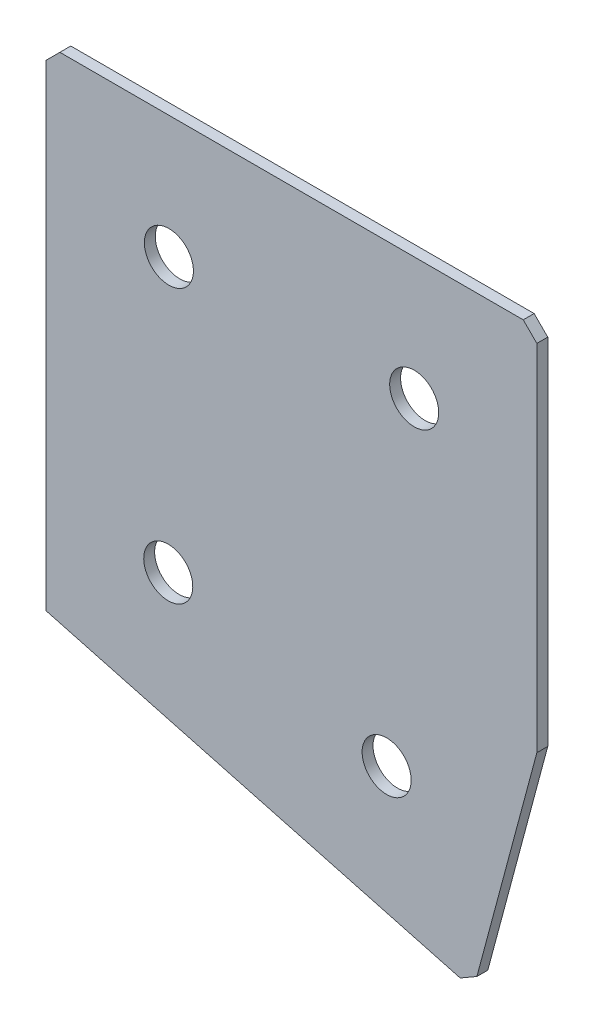
ISO-10303-21;
HEADER;
FILE_DESCRIPTION(('STEP AP214'),'2;1');
FILE_NAME('part.step','',(''),(''),'','','');
FILE_SCHEMA(('AUTOMOTIVE_DESIGN { 1 0 10303 214 1 1 1 1 }'));
ENDSEC;
DATA;
#1=APPLICATION_CONTEXT('core data for automotive mechanical design processes');
#2=APPLICATION_PROTOCOL_DEFINITION('international standard','automotive_design',2000,#1);
#3=PRODUCT_CONTEXT('',#1,'mechanical');
#4=PRODUCT('Part','Part','',(#3));
#5=PRODUCT_RELATED_PRODUCT_CATEGORY('part','',(#4));
#6=PRODUCT_DEFINITION_FORMATION('','',#4);
#7=PRODUCT_DEFINITION_CONTEXT('part definition',#1,'design');
#8=PRODUCT_DEFINITION('design','',#6,#7);
#9=PRODUCT_DEFINITION_SHAPE('','',#8);
#10=(LENGTH_UNIT() NAMED_UNIT(*) SI_UNIT(.MILLI.,.METRE.));
#11=(NAMED_UNIT(*) PLANE_ANGLE_UNIT() SI_UNIT($,.RADIAN.));
#12=(NAMED_UNIT(*) SI_UNIT($,.STERADIAN.) SOLID_ANGLE_UNIT());
#13=UNCERTAINTY_MEASURE_WITH_UNIT(LENGTH_MEASURE(1.E-05),#10,'distance_accuracy_value','');
#14=(GEOMETRIC_REPRESENTATION_CONTEXT(3) GLOBAL_UNCERTAINTY_ASSIGNED_CONTEXT((#13)) GLOBAL_UNIT_ASSIGNED_CONTEXT((#10,
#11,#12)) REPRESENTATION_CONTEXT('',''));
#15=CARTESIAN_POINT('',(0.,0.,0.));
#16=DIRECTION('',(0.,0.,1.));
#17=DIRECTION('',(1.,0.,0.));
#18=AXIS2_PLACEMENT_3D('',#15,#16,#17);
#19=CARTESIAN_POINT('',(0.,0.,-2.));
#20=DIRECTION('',(1.,0.,0.));
#21=DIRECTION('',(0.,0.,-1.));
#22=AXIS2_PLACEMENT_3D('',#19,#20,#21);
#23=PLANE('',#22);
#24=DIRECTION('',(0.,1.,0.));
#25=VECTOR('',#24,1.);
#26=CARTESIAN_POINT('',(0.,0.,0.));
#27=LINE('',#26,#25);
#28=CARTESIAN_POINT('',(0.,-90.,0.));
#29=VERTEX_POINT('',#28);
#30=CARTESIAN_POINT('',(0.,-2.5,0.));
#31=VERTEX_POINT('',#30);
#32=EDGE_CURVE('E137',#29,#31,#27,.T.);
#33=ORIENTED_EDGE('',*,*,#32,.T.);
#34=DIRECTION('',(0.,0.,-1.));
#35=VECTOR('',#34,1.);
#36=CARTESIAN_POINT('',(0.,-2.5,-2.));
#37=LINE('',#36,#35);
#38=CARTESIAN_POINT('',(0.,-2.5,-2.));
#39=VERTEX_POINT('',#38);
#40=EDGE_CURVE('E11',#31,#39,#37,.T.);
#41=ORIENTED_EDGE('',*,*,#40,.T.);
#42=DIRECTION('',(0.,1.,0.));
#43=VECTOR('',#42,1.);
#44=CARTESIAN_POINT('',(0.,0.,-2.));
#45=LINE('',#44,#43);
#46=CARTESIAN_POINT('',(0.,-90.,-2.));
#47=VERTEX_POINT('',#46);
#48=EDGE_CURVE('E153',#47,#39,#45,.T.);
#49=ORIENTED_EDGE('',*,*,#48,.F.);
#50=DIRECTION('',(0.,0.,1.));
#51=VECTOR('',#50,1.);
#52=CARTESIAN_POINT('',(0.,-90.,-2.));
#53=LINE('',#52,#51);
#54=EDGE_CURVE('E125',#47,#29,#53,.T.);
#55=ORIENTED_EDGE('',*,*,#54,.T.);
#56=EDGE_LOOP('',(#33,#41,#49,#55));
#57=FACE_BOUND('',#56,.T.);
#58=ADVANCED_FACE('F39',(#57),#23,.F.);
#59=CARTESIAN_POINT('',(0.,0.,-2.));
#60=DIRECTION('',(0.,-1.,0.));
#61=DIRECTION('',(0.,0.,-1.));
#62=AXIS2_PLACEMENT_3D('',#59,#60,#61);
#63=PLANE('',#62);
#64=DIRECTION('',(1.,0.,0.));
#65=VECTOR('',#64,1.);
#66=CARTESIAN_POINT('',(0.,0.,0.));
#67=LINE('',#66,#65);
#68=CARTESIAN_POINT('',(2.5,0.,0.));
#69=VERTEX_POINT('',#68);
#70=CARTESIAN_POINT('',(87.4999999999999,0.,0.));
#71=VERTEX_POINT('',#70);
#72=EDGE_CURVE('E141',#69,#71,#67,.T.);
#73=ORIENTED_EDGE('',*,*,#72,.T.);
#74=DIRECTION('',(0.,0.,-1.));
#75=VECTOR('',#74,1.);
#76=CARTESIAN_POINT('',(87.5,0.,-2.));
#77=LINE('',#76,#75);
#78=CARTESIAN_POINT('',(87.4999999999999,0.,-2.));
#79=VERTEX_POINT('',#78);
#80=EDGE_CURVE('E48',#71,#79,#77,.T.);
#81=ORIENTED_EDGE('',*,*,#80,.T.);
#82=DIRECTION('',(1.,0.,0.));
#83=VECTOR('',#82,1.);
#84=CARTESIAN_POINT('',(0.,0.,-2.));
#85=LINE('',#84,#83);
#86=CARTESIAN_POINT('',(2.5,0.,-2.));
#87=VERTEX_POINT('',#86);
#88=EDGE_CURVE('E113',#87,#79,#85,.T.);
#89=ORIENTED_EDGE('',*,*,#88,.F.);
#90=DIRECTION('',(0.,0.,1.));
#91=VECTOR('',#90,1.);
#92=CARTESIAN_POINT('',(2.5,0.,-2.));
#93=LINE('',#92,#91);
#94=EDGE_CURVE('E182',#87,#69,#93,.T.);
#95=ORIENTED_EDGE('',*,*,#94,.T.);
#96=EDGE_LOOP('',(#73,#81,#89,#95));
#97=FACE_BOUND('',#96,.T.);
#98=ADVANCED_FACE('F188',(#97),#63,.F.);
#99=CARTESIAN_POINT('',(90.,0.,-2.));
#100=DIRECTION('',(-1.,0.,0.));
#101=DIRECTION('',(0.,0.,1.));
#102=AXIS2_PLACEMENT_3D('',#99,#100,#101);
#103=PLANE('',#102);
#104=DIRECTION('',(0.,-1.,0.));
#105=VECTOR('',#104,1.);
#106=CARTESIAN_POINT('',(90.,0.,-2.));
#107=LINE('',#106,#105);
#108=CARTESIAN_POINT('',(90.,-2.50000000000003,-2.));
#109=VERTEX_POINT('',#108);
#110=CARTESIAN_POINT('',(90.,-67.5279992003474,-2.));
#111=VERTEX_POINT('',#110);
#112=EDGE_CURVE('E103',#109,#111,#107,.T.);
#113=ORIENTED_EDGE('',*,*,#112,.F.);
#114=DIRECTION('',(0.,0.,1.));
#115=VECTOR('',#114,1.);
#116=CARTESIAN_POINT('',(90.,-2.50000000000003,-2.));
#117=LINE('',#116,#115);
#118=CARTESIAN_POINT('',(90.,-2.50000000000003,0.));
#119=VERTEX_POINT('',#118);
#120=EDGE_CURVE('E179',#109,#119,#117,.T.);
#121=ORIENTED_EDGE('',*,*,#120,.T.);
#122=DIRECTION('',(0.,-1.,0.));
#123=VECTOR('',#122,1.);
#124=CARTESIAN_POINT('',(90.,0.,0.));
#125=LINE('',#124,#123);
#126=CARTESIAN_POINT('',(90.,-67.5279992003474,0.));
#127=VERTEX_POINT('',#126);
#128=EDGE_CURVE('E119',#119,#127,#125,.T.);
#129=ORIENTED_EDGE('',*,*,#128,.T.);
#130=DIRECTION('',(0.,0.,1.));
#131=VECTOR('',#130,1.);
#132=CARTESIAN_POINT('',(90.,-67.5279992003474,-2.));
#133=LINE('',#132,#131);
#134=EDGE_CURVE('E116',#111,#127,#133,.T.);
#135=ORIENTED_EDGE('',*,*,#134,.F.);
#136=EDGE_LOOP('',(#113,#121,#129,#135));
#137=FACE_BOUND('',#136,.T.);
#138=ADVANCED_FACE('F117',(#137),#103,.F.);
#139=CARTESIAN_POINT('',(78.3531429703865,-110.994661383355,-2.));
#140=DIRECTION('',(-0.965925826289068,0.258819045102521,0.));
#141=DIRECTION('',(-0.258819045102521,-0.965925826289068,0.));
#142=AXIS2_PLACEMENT_3D('',#139,#140,#141);
#143=PLANE('',#142);
#144=DIRECTION('',(-0.258819045102521,-0.965925826289068,0.));
#145=VECTOR('',#144,1.);
#146=CARTESIAN_POINT('',(78.3531429703865,-110.994661383355,0.));
#147=LINE('',#146,#145);
#148=CARTESIAN_POINT('',(79.0001905831429,-108.579846817633,0.));
#149=VERTEX_POINT('',#148);
#150=EDGE_CURVE('E147',#127,#149,#147,.T.);
#151=ORIENTED_EDGE('',*,*,#150,.T.);
#152=DIRECTION('',(0.,0.,-1.));
#153=VECTOR('',#152,1.);
#154=CARTESIAN_POINT('',(79.0001905831429,-108.579846817633,-2.));
#155=LINE('',#154,#153);
#156=CARTESIAN_POINT('',(79.0001905831429,-108.579846817633,-2.));
#157=VERTEX_POINT('',#156);
#158=EDGE_CURVE('E129',#149,#157,#155,.T.);
#159=ORIENTED_EDGE('',*,*,#158,.T.);
#160=DIRECTION('',(-0.258819045102521,-0.965925826289068,0.));
#161=VECTOR('',#160,1.);
#162=CARTESIAN_POINT('',(78.3531429703865,-110.994661383355,-2.));
#163=LINE('',#162,#161);
#164=EDGE_CURVE('E107',#111,#157,#163,.T.);
#165=ORIENTED_EDGE('',*,*,#164,.F.);
#166=ORIENTED_EDGE('',*,*,#134,.T.);
#167=EDGE_LOOP('',(#151,#159,#165,#166));
#168=FACE_BOUND('',#167,.T.);
#169=ADVANCED_FACE('F127',(#168),#143,.F.);
#170=CARTESIAN_POINT('',(0.,-90.,-2.));
#171=DIRECTION('',(0.258819045102522,0.965925826289068,0.));
#172=DIRECTION('',(-0.965925826289068,0.258819045102522,0.));
#173=AXIS2_PLACEMENT_3D('',#170,#171,#172);
#174=PLANE('',#173);
#175=DIRECTION('',(-0.965925826289068,0.258819045102522,0.));
#176=VECTOR('',#175,1.);
#177=CARTESIAN_POINT('',(0.,-90.,-2.));
#178=LINE('',#177,#176);
#179=CARTESIAN_POINT('',(75.9383284046638,-110.347613770599,-2.));
#180=VERTEX_POINT('',#179);
#181=EDGE_CURVE('E131',#180,#47,#178,.T.);
#182=ORIENTED_EDGE('',*,*,#181,.F.);
#183=DIRECTION('',(0.,0.,1.));
#184=VECTOR('',#183,1.);
#185=CARTESIAN_POINT('',(75.9383284046638,-110.347613770599,-2.));
#186=LINE('',#185,#184);
#187=CARTESIAN_POINT('',(75.9383284046638,-110.347613770599,0.));
#188=VERTEX_POINT('',#187);
#189=EDGE_CURVE('E124',#180,#188,#186,.T.);
#190=ORIENTED_EDGE('',*,*,#189,.T.);
#191=DIRECTION('',(-0.965925826289068,0.258819045102522,0.));
#192=VECTOR('',#191,1.);
#193=CARTESIAN_POINT('',(0.,-90.,0.));
#194=LINE('',#193,#192);
#195=EDGE_CURVE('E150',#188,#29,#194,.T.);
#196=ORIENTED_EDGE('',*,*,#195,.T.);
#197=ORIENTED_EDGE('',*,*,#54,.F.);
#198=EDGE_LOOP('',(#182,#190,#196,#197));
#199=FACE_BOUND('',#198,.T.);
#200=ADVANCED_FACE('F218',(#199),#174,.F.);
#201=CARTESIAN_POINT('',(0.,0.,-2.));
#202=DIRECTION('',(0.,0.,1.));
#203=DIRECTION('',(1.,0.,0.));
#204=AXIS2_PLACEMENT_3D('',#201,#202,#203);
#205=PLANE('',#204);
#206=CARTESIAN_POINT('',(22.3803787042603,-72.7030903408824,-2.));
#207=DIRECTION('',(0.,0.,-1.));
#208=DIRECTION('',(0.,1.,0.));
#209=AXIS2_PLACEMENT_3D('',#206,#207,#208);
#210=CIRCLE('',#209,4.5);
#211=CARTESIAN_POINT('',(22.3803787042603,-68.2030903408824,-2.));
#212=VERTEX_POINT('',#211);
#213=EDGE_CURVE('E250',#212,#212,#210,.T.);
#214=ORIENTED_EDGE('',*,*,#213,.F.);
#215=EDGE_LOOP('',(#214));
#216=FACE_BOUND('',#215,.T.);
#217=CARTESIAN_POINT('',(62.4432403936892,-83.4379017770447,-2.00000000000001));
#218=DIRECTION('',(0.,0.,-1.));
#219=DIRECTION('',(0.,1.,0.));
#220=AXIS2_PLACEMENT_3D('',#217,#218,#219);
#221=CIRCLE('',#220,4.5);
#222=CARTESIAN_POINT('',(62.4432403936892,-78.9379017770447,-2.));
#223=VERTEX_POINT('',#222);
#224=EDGE_CURVE('E254',#223,#223,#221,.T.);
#225=ORIENTED_EDGE('',*,*,#224,.F.);
#226=EDGE_LOOP('',(#225));
#227=FACE_BOUND('',#226,.T.);
#228=CARTESIAN_POINT('',(22.5,-22.5,-2.));
#229=DIRECTION('',(0.,0.,-1.));
#230=DIRECTION('',(0.,1.,0.));
#231=AXIS2_PLACEMENT_3D('',#228,#229,#230);
#232=CIRCLE('',#231,4.5);
#233=CARTESIAN_POINT('',(22.5,-18.,-2.));
#234=VERTEX_POINT('',#233);
#235=EDGE_CURVE('E264',#234,#234,#232,.T.);
#236=ORIENTED_EDGE('',*,*,#235,.F.);
#237=EDGE_LOOP('',(#236));
#238=FACE_BOUND('',#237,.T.);
#239=CARTESIAN_POINT('',(67.5,-22.5,-2.));
#240=DIRECTION('',(0.,0.,-1.));
#241=DIRECTION('',(0.,1.,0.));
#242=AXIS2_PLACEMENT_3D('',#239,#240,#241);
#243=CIRCLE('',#242,4.5);
#244=CARTESIAN_POINT('',(67.5,-18.,-2.));
#245=VERTEX_POINT('',#244);
#246=EDGE_CURVE('E272',#245,#245,#243,.T.);
#247=ORIENTED_EDGE('',*,*,#246,.F.);
#248=EDGE_LOOP('',(#247));
#249=FACE_BOUND('',#248,.T.);
#250=ORIENTED_EDGE('',*,*,#164,.T.);
#251=DIRECTION('',(0.866025403784437,0.500000000000003,0.));
#252=VECTOR('',#251,1.);
#253=CARTESIAN_POINT('',(75.9383284046639,-110.347613770599,-2.));
#254=LINE('',#253,#252);
#255=EDGE_CURVE('E176',#157,#180,#254,.F.);
#256=ORIENTED_EDGE('',*,*,#255,.T.);
#257=ORIENTED_EDGE('',*,*,#181,.T.);
#258=ORIENTED_EDGE('',*,*,#48,.T.);
#259=DIRECTION('',(-0.707106781186548,-0.707106781186548,0.));
#260=VECTOR('',#259,1.);
#261=CARTESIAN_POINT('',(2.5,0.,-2.));
#262=LINE('',#261,#260);
#263=EDGE_CURVE('E171',#39,#87,#262,.F.);
#264=ORIENTED_EDGE('',*,*,#263,.T.);
#265=ORIENTED_EDGE('',*,*,#88,.T.);
#266=DIRECTION('',(-0.707106781186548,0.707106781186548,0.));
#267=VECTOR('',#266,1.);
#268=CARTESIAN_POINT('',(90.,-2.50000000000003,-2.));
#269=LINE('',#268,#267);
#270=EDGE_CURVE('E55',#79,#109,#269,.F.);
#271=ORIENTED_EDGE('',*,*,#270,.T.);
#272=ORIENTED_EDGE('',*,*,#112,.T.);
#273=EDGE_LOOP('',(#250,#256,#257,#258,#264,#265,#271,#272));
#274=FACE_BOUND('',#273,.T.);
#275=ADVANCED_FACE('F105',(#216,#227,#238,#249,#274),#205,.F.);
#276=CARTESIAN_POINT('',(0.,0.,0.));
#277=DIRECTION('',(0.,0.,1.));
#278=DIRECTION('',(1.,0.,0.));
#279=AXIS2_PLACEMENT_3D('',#276,#277,#278);
#280=PLANE('',#279);
#281=CARTESIAN_POINT('',(22.3803787042603,-72.7030903408824,0.));
#282=DIRECTION('',(0.,0.,-1.));
#283=DIRECTION('',(0.,1.,0.));
#284=AXIS2_PLACEMENT_3D('',#281,#282,#283);
#285=CIRCLE('',#284,4.5);
#286=CARTESIAN_POINT('',(22.3803787042603,-68.2030903408824,0.));
#287=VERTEX_POINT('',#286);
#288=EDGE_CURVE('E247',#287,#287,#285,.T.);
#289=ORIENTED_EDGE('',*,*,#288,.T.);
#290=EDGE_LOOP('',(#289));
#291=FACE_BOUND('',#290,.T.);
#292=CARTESIAN_POINT('',(62.4432403936892,-83.4379017770447,0.));
#293=DIRECTION('',(0.,0.,-1.));
#294=DIRECTION('',(0.,1.,0.));
#295=AXIS2_PLACEMENT_3D('',#292,#293,#294);
#296=CIRCLE('',#295,4.5);
#297=CARTESIAN_POINT('',(62.4432403936892,-78.9379017770447,0.));
#298=VERTEX_POINT('',#297);
#299=EDGE_CURVE('E260',#298,#298,#296,.T.);
#300=ORIENTED_EDGE('',*,*,#299,.T.);
#301=EDGE_LOOP('',(#300));
#302=FACE_BOUND('',#301,.T.);
#303=CARTESIAN_POINT('',(22.5,-22.5,0.));
#304=DIRECTION('',(0.,0.,-1.));
#305=DIRECTION('',(0.,1.,0.));
#306=AXIS2_PLACEMENT_3D('',#303,#304,#305);
#307=CIRCLE('',#306,4.5);
#308=CARTESIAN_POINT('',(22.5,-18.,0.));
#309=VERTEX_POINT('',#308);
#310=EDGE_CURVE('E268',#309,#309,#307,.T.);
#311=ORIENTED_EDGE('',*,*,#310,.T.);
#312=EDGE_LOOP('',(#311));
#313=FACE_BOUND('',#312,.T.);
#314=CARTESIAN_POINT('',(67.5,-22.5,0.));
#315=DIRECTION('',(0.,0.,-1.));
#316=DIRECTION('',(0.,1.,0.));
#317=AXIS2_PLACEMENT_3D('',#314,#315,#316);
#318=CIRCLE('',#317,4.5);
#319=CARTESIAN_POINT('',(67.5,-18.,0.));
#320=VERTEX_POINT('',#319);
#321=EDGE_CURVE('E142',#320,#320,#318,.T.);
#322=ORIENTED_EDGE('',*,*,#321,.T.);
#323=EDGE_LOOP('',(#322));
#324=FACE_BOUND('',#323,.T.);
#325=ORIENTED_EDGE('',*,*,#195,.F.);
#326=DIRECTION('',(-0.866025403784437,-0.500000000000003,0.));
#327=VECTOR('',#326,1.);
#328=CARTESIAN_POINT('',(66.7665004873326,-115.642971087631,0.));
#329=LINE('',#328,#327);
#330=EDGE_CURVE('E166',#188,#149,#329,.F.);
#331=ORIENTED_EDGE('',*,*,#330,.T.);
#332=ORIENTED_EDGE('',*,*,#150,.F.);
#333=ORIENTED_EDGE('',*,*,#128,.F.);
#334=DIRECTION('',(0.707106781186548,-0.707106781186548,0.));
#335=VECTOR('',#334,1.);
#336=CARTESIAN_POINT('',(43.75,43.75,0.));
#337=LINE('',#336,#335);
#338=EDGE_CURVE('E163',#119,#71,#337,.F.);
#339=ORIENTED_EDGE('',*,*,#338,.T.);
#340=ORIENTED_EDGE('',*,*,#72,.F.);
#341=DIRECTION('',(0.707106781186548,0.707106781186548,0.));
#342=VECTOR('',#341,1.);
#343=CARTESIAN_POINT('',(1.25,-1.25,0.));
#344=LINE('',#343,#342);
#345=EDGE_CURVE('E160',#69,#31,#344,.F.);
#346=ORIENTED_EDGE('',*,*,#345,.T.);
#347=ORIENTED_EDGE('',*,*,#32,.F.);
#348=EDGE_LOOP('',(#325,#331,#332,#333,#339,#340,#346,#347));
#349=FACE_BOUND('',#348,.T.);
#350=ADVANCED_FACE('F193',(#291,#302,#313,#324,#349),#280,.T.);
#351=CARTESIAN_POINT('',(67.5,-22.5,-2.));
#352=DIRECTION('',(0.,0.,-1.));
#353=DIRECTION('',(0.,1.,0.));
#354=AXIS2_PLACEMENT_3D('',#351,#352,#353);
#355=CYLINDRICAL_SURFACE('',#354,4.5);
#356=ORIENTED_EDGE('',*,*,#321,.F.);
#357=EDGE_LOOP('',(#356));
#358=FACE_BOUND('',#357,.T.);
#359=ORIENTED_EDGE('',*,*,#246,.T.);
#360=EDGE_LOOP('',(#359));
#361=FACE_BOUND('',#360,.T.);
#362=ADVANCED_FACE('F224',(#358,#361),#355,.F.);
#363=CARTESIAN_POINT('',(22.5,-22.5,-2.));
#364=DIRECTION('',(0.,0.,-1.));
#365=DIRECTION('',(0.,1.,0.));
#366=AXIS2_PLACEMENT_3D('',#363,#364,#365);
#367=CYLINDRICAL_SURFACE('',#366,4.5);
#368=ORIENTED_EDGE('',*,*,#310,.F.);
#369=EDGE_LOOP('',(#368));
#370=FACE_BOUND('',#369,.T.);
#371=ORIENTED_EDGE('',*,*,#235,.T.);
#372=EDGE_LOOP('',(#371));
#373=FACE_BOUND('',#372,.T.);
#374=ADVANCED_FACE('F231',(#370,#373),#367,.F.);
#375=CARTESIAN_POINT('',(62.4432403936892,-83.4379017770447,-2.00000000000001));
#376=DIRECTION('',(0.,0.,-1.));
#377=DIRECTION('',(0.,1.,0.));
#378=AXIS2_PLACEMENT_3D('',#375,#376,#377);
#379=CYLINDRICAL_SURFACE('',#378,4.5);
#380=ORIENTED_EDGE('',*,*,#299,.F.);
#381=EDGE_LOOP('',(#380));
#382=FACE_BOUND('',#381,.T.);
#383=ORIENTED_EDGE('',*,*,#224,.T.);
#384=EDGE_LOOP('',(#383));
#385=FACE_BOUND('',#384,.T.);
#386=ADVANCED_FACE('F235',(#382,#385),#379,.F.);
#387=CARTESIAN_POINT('',(22.3803787042603,-72.7030903408824,-2.));
#388=DIRECTION('',(0.,0.,-1.));
#389=DIRECTION('',(0.,1.,0.));
#390=AXIS2_PLACEMENT_3D('',#387,#388,#389);
#391=CYLINDRICAL_SURFACE('',#390,4.5);
#392=ORIENTED_EDGE('',*,*,#288,.F.);
#393=EDGE_LOOP('',(#392));
#394=FACE_BOUND('',#393,.T.);
#395=ORIENTED_EDGE('',*,*,#213,.T.);
#396=EDGE_LOOP('',(#395));
#397=FACE_BOUND('',#396,.T.);
#398=ADVANCED_FACE('F203',(#394,#397),#391,.F.);
#399=CARTESIAN_POINT('',(75.9383284046639,-110.347613770599,-2.));
#400=DIRECTION('',(-0.500000000000003,0.866025403784437,0.));
#401=DIRECTION('',(0.,0.,1.));
#402=AXIS2_PLACEMENT_3D('',#399,#400,#401);
#403=PLANE('',#402);
#404=ORIENTED_EDGE('',*,*,#255,.F.);
#405=ORIENTED_EDGE('',*,*,#158,.F.);
#406=ORIENTED_EDGE('',*,*,#330,.F.);
#407=ORIENTED_EDGE('',*,*,#189,.F.);
#408=EDGE_LOOP('',(#404,#405,#406,#407));
#409=FACE_BOUND('',#408,.T.);
#410=ADVANCED_FACE('F198',(#409),#403,.F.);
#411=CARTESIAN_POINT('',(90.,-2.50000000000003,-2.));
#412=DIRECTION('',(-0.707106781186547,-0.707106781186547,0.));
#413=DIRECTION('',(0.,0.,1.));
#414=AXIS2_PLACEMENT_3D('',#411,#412,#413);
#415=PLANE('',#414);
#416=ORIENTED_EDGE('',*,*,#270,.F.);
#417=ORIENTED_EDGE('',*,*,#80,.F.);
#418=ORIENTED_EDGE('',*,*,#338,.F.);
#419=ORIENTED_EDGE('',*,*,#120,.F.);
#420=EDGE_LOOP('',(#416,#417,#418,#419));
#421=FACE_BOUND('',#420,.T.);
#422=ADVANCED_FACE('F196',(#421),#415,.F.);
#423=CARTESIAN_POINT('',(2.5,0.,-2.));
#424=DIRECTION('',(0.707106781186547,-0.707106781186547,0.));
#425=DIRECTION('',(0.,0.,1.));
#426=AXIS2_PLACEMENT_3D('',#423,#424,#425);
#427=PLANE('',#426);
#428=ORIENTED_EDGE('',*,*,#263,.F.);
#429=ORIENTED_EDGE('',*,*,#40,.F.);
#430=ORIENTED_EDGE('',*,*,#345,.F.);
#431=ORIENTED_EDGE('',*,*,#94,.F.);
#432=EDGE_LOOP('',(#428,#429,#430,#431));
#433=FACE_BOUND('',#432,.T.);
#434=ADVANCED_FACE('F41',(#433),#427,.F.);
#435=CLOSED_SHELL('',(#58,#98,#138,#169,#200,#275,#350,#362,#374,#386,#398,#410,#422,#434));
#436=MANIFOLD_SOLID_BREP('B2',#435);
#437=ADVANCED_BREP_SHAPE_REPRESENTATION('',(#18,#436),#14);
#438=SHAPE_DEFINITION_REPRESENTATION(#9,#437);
ENDSEC;
END-ISO-10303-21;
